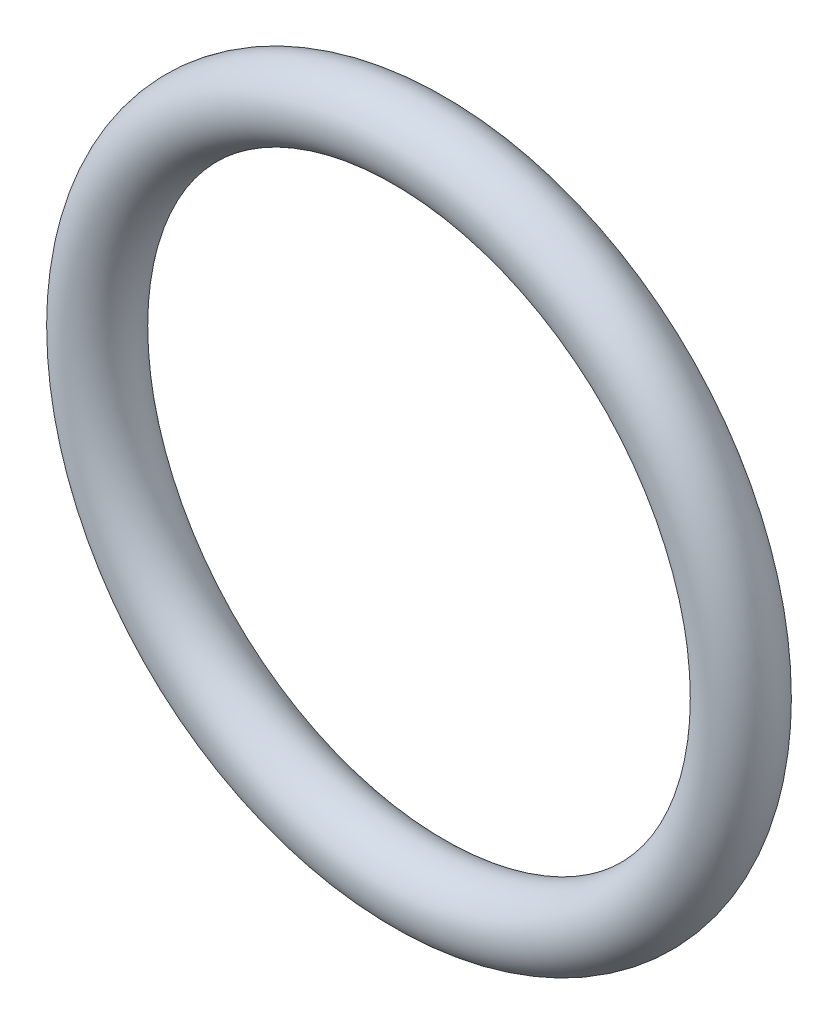
ISO-10303-21;
HEADER;
FILE_DESCRIPTION(('STEP AP214'),'2;1');
FILE_NAME('part.step','',(''),(''),'','','');
FILE_SCHEMA(('AUTOMOTIVE_DESIGN { 1 0 10303 214 1 1 1 1 }'));
ENDSEC;
DATA;
#1=APPLICATION_CONTEXT('core data for automotive mechanical design processes');
#2=APPLICATION_PROTOCOL_DEFINITION('international standard','automotive_design',2000,#1);
#3=PRODUCT_CONTEXT('',#1,'mechanical');
#4=PRODUCT('Part','Part','',(#3));
#5=PRODUCT_RELATED_PRODUCT_CATEGORY('part','',(#4));
#6=PRODUCT_DEFINITION_FORMATION('','',#4);
#7=PRODUCT_DEFINITION_CONTEXT('part definition',#1,'design');
#8=PRODUCT_DEFINITION('design','',#6,#7);
#9=PRODUCT_DEFINITION_SHAPE('','',#8);
#10=(LENGTH_UNIT() NAMED_UNIT(*) SI_UNIT(.MILLI.,.METRE.));
#11=(NAMED_UNIT(*) PLANE_ANGLE_UNIT() SI_UNIT($,.RADIAN.));
#12=(NAMED_UNIT(*) SI_UNIT($,.STERADIAN.) SOLID_ANGLE_UNIT());
#13=UNCERTAINTY_MEASURE_WITH_UNIT(LENGTH_MEASURE(1.E-05),#10,'distance_accuracy_value','');
#14=(GEOMETRIC_REPRESENTATION_CONTEXT(3) GLOBAL_UNCERTAINTY_ASSIGNED_CONTEXT((#13)) GLOBAL_UNIT_ASSIGNED_CONTEXT((#10,
#11,#12)) REPRESENTATION_CONTEXT('',''));
#15=CARTESIAN_POINT('',(0.,0.,0.));
#16=DIRECTION('',(0.,0.,1.));
#17=DIRECTION('',(1.,0.,0.));
#18=AXIS2_PLACEMENT_3D('',#15,#16,#17);
#19=CARTESIAN_POINT('',(0.,0.,36.8999999999964));
#20=DIRECTION('',(0.,0.,1.));
#21=DIRECTION('',(1.,0.,0.));
#22=AXIS2_PLACEMENT_3D('',#19,#20,#21);
#23=TOROIDAL_SURFACE('',#22,6.75,0.75);
#24=CARTESIAN_POINT('',(7.5,0.,36.8999999999964));
#25=VERTEX_POINT('',#24);
#26=VERTEX_LOOP('',#25);
#27=FACE_BOUND('',#26,.T.);
#28=ADVANCED_FACE('F33',(#27),#23,.T.);
#29=CLOSED_SHELL('',(#28));
#30=MANIFOLD_SOLID_BREP('B2',#29);
#31=ADVANCED_BREP_SHAPE_REPRESENTATION('',(#18,#30),#14);
#32=SHAPE_DEFINITION_REPRESENTATION(#9,#31);
ENDSEC;
END-ISO-10303-21;
